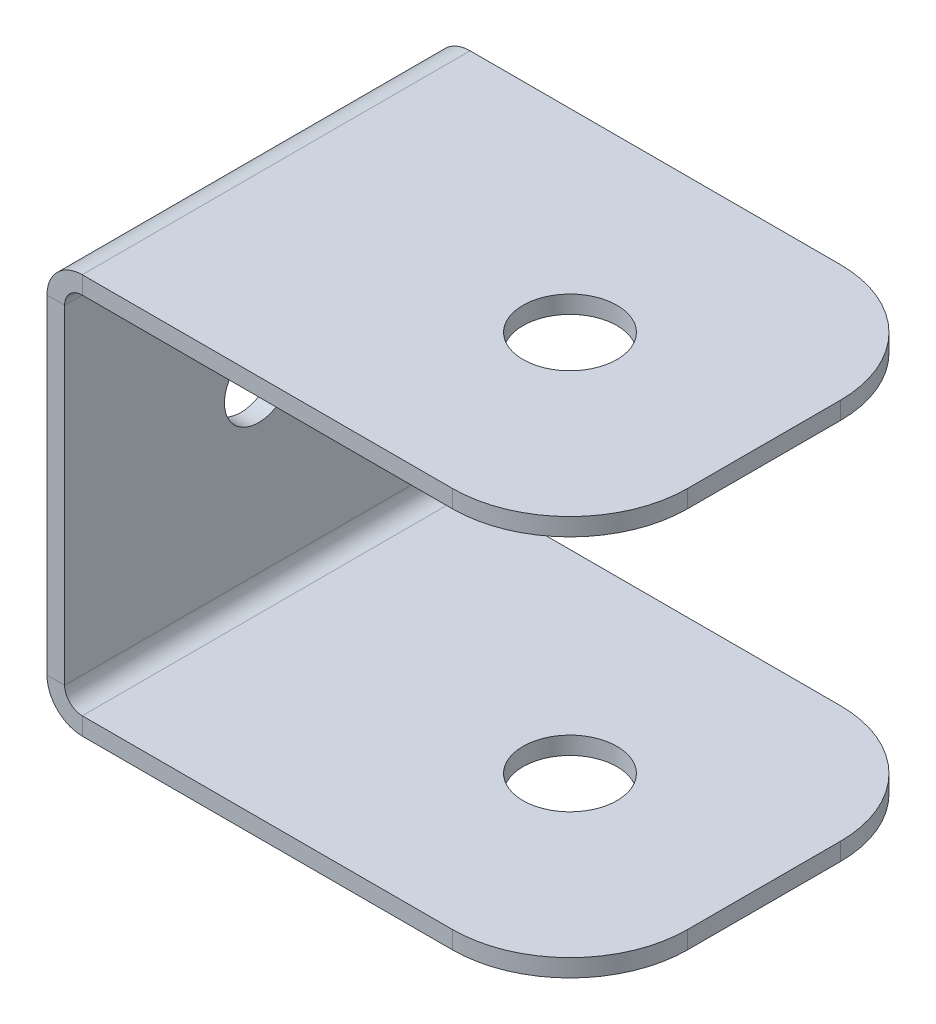
ISO-10303-21;
HEADER;
FILE_DESCRIPTION(('STEP AP214'),'2;1');
FILE_NAME('part.step','',(''),(''),'','','');
FILE_SCHEMA(('AUTOMOTIVE_DESIGN { 1 0 10303 214 1 1 1 1 }'));
ENDSEC;
DATA;
#1=APPLICATION_CONTEXT('core data for automotive mechanical design processes');
#2=APPLICATION_PROTOCOL_DEFINITION('international standard','automotive_design',2000,#1);
#3=PRODUCT_CONTEXT('',#1,'mechanical');
#4=PRODUCT('Part','Part','',(#3));
#5=PRODUCT_RELATED_PRODUCT_CATEGORY('part','',(#4));
#6=PRODUCT_DEFINITION_FORMATION('','',#4);
#7=PRODUCT_DEFINITION_CONTEXT('part definition',#1,'design');
#8=PRODUCT_DEFINITION('design','',#6,#7);
#9=PRODUCT_DEFINITION_SHAPE('','',#8);
#10=(LENGTH_UNIT() NAMED_UNIT(*) SI_UNIT(.MILLI.,.METRE.));
#11=(NAMED_UNIT(*) PLANE_ANGLE_UNIT() SI_UNIT($,.RADIAN.));
#12=(NAMED_UNIT(*) SI_UNIT($,.STERADIAN.) SOLID_ANGLE_UNIT());
#13=UNCERTAINTY_MEASURE_WITH_UNIT(LENGTH_MEASURE(1.E-05),#10,'distance_accuracy_value','');
#14=(GEOMETRIC_REPRESENTATION_CONTEXT(3) GLOBAL_UNCERTAINTY_ASSIGNED_CONTEXT((#13)) GLOBAL_UNIT_ASSIGNED_CONTEXT((#10,
#11,#12)) REPRESENTATION_CONTEXT('',''));
#15=CARTESIAN_POINT('',(0.,0.,0.));
#16=DIRECTION('',(0.,0.,1.));
#17=DIRECTION('',(1.,0.,0.));
#18=AXIS2_PLACEMENT_3D('',#15,#16,#17);
#19=CARTESIAN_POINT('',(0.,14.,16.5));
#20=DIRECTION('',(0.,0.,1.));
#21=DIRECTION('',(1.,0.,0.));
#22=AXIS2_PLACEMENT_3D('',#19,#20,#21);
#23=PLANE('',#22);
#24=DIRECTION('',(-1.,0.,0.));
#25=VECTOR('',#24,1.);
#26=CARTESIAN_POINT('',(0.,14.,16.5));
#27=LINE('',#26,#25);
#28=CARTESIAN_POINT('',(0.,14.,16.5));
#29=VERTEX_POINT('',#28);
#30=CARTESIAN_POINT('',(-1.5,14.,16.5));
#31=VERTEX_POINT('',#30);
#32=EDGE_CURVE('E319',#29,#31,#27,.T.);
#33=ORIENTED_EDGE('',*,*,#32,.F.);
#34=CARTESIAN_POINT('',(1.5,14.,16.5));
#35=DIRECTION('',(0.,0.,-1.));
#36=DIRECTION('',(-1.,0.,0.));
#37=AXIS2_PLACEMENT_3D('',#34,#35,#36);
#38=CIRCLE('',#37,1.5);
#39=CARTESIAN_POINT('',(1.5,15.5,16.5));
#40=VERTEX_POINT('',#39);
#41=EDGE_CURVE('E203',#40,#29,#38,.F.);
#42=ORIENTED_EDGE('',*,*,#41,.F.);
#43=DIRECTION('',(0.,-1.,0.));
#44=VECTOR('',#43,1.);
#45=CARTESIAN_POINT('',(1.5,17.,16.5));
#46=LINE('',#45,#44);
#47=CARTESIAN_POINT('',(1.5,17.,16.5));
#48=VERTEX_POINT('',#47);
#49=EDGE_CURVE('E315',#48,#40,#46,.T.);
#50=ORIENTED_EDGE('',*,*,#49,.F.);
#51=CARTESIAN_POINT('',(1.5,14.,16.5));
#52=DIRECTION('',(0.,0.,1.));
#53=DIRECTION('',(1.,0.,0.));
#54=AXIS2_PLACEMENT_3D('',#51,#52,#53);
#55=CIRCLE('',#54,3.);
#56=EDGE_CURVE('E216',#48,#31,#55,.T.);
#57=ORIENTED_EDGE('',*,*,#56,.T.);
#58=EDGE_LOOP('',(#33,#42,#50,#57));
#59=FACE_BOUND('',#58,.T.);
#60=ADVANCED_FACE('F41',(#59),#23,.T.);
#61=CARTESIAN_POINT('',(1.5,17.,16.5));
#62=DIRECTION('',(0.,0.,1.));
#63=DIRECTION('',(1.,0.,0.));
#64=AXIS2_PLACEMENT_3D('',#61,#62,#63);
#65=PLANE('',#64);
#66=DIRECTION('',(0.,-1.,0.));
#67=VECTOR('',#66,1.);
#68=CARTESIAN_POINT('',(0.,15.5,16.5));
#69=LINE('',#68,#67);
#70=CARTESIAN_POINT('',(0.,-14.,16.5));
#71=VERTEX_POINT('',#70);
#72=EDGE_CURVE('E199',#29,#71,#69,.T.);
#73=ORIENTED_EDGE('',*,*,#72,.F.);
#74=ORIENTED_EDGE('',*,*,#32,.T.);
#75=DIRECTION('',(0.,-1.,0.));
#76=VECTOR('',#75,1.);
#77=CARTESIAN_POINT('',(-1.5,15.5,16.5));
#78=LINE('',#77,#76);
#79=CARTESIAN_POINT('',(-1.5,-14.,16.5));
#80=VERTEX_POINT('',#79);
#81=EDGE_CURVE('E220',#31,#80,#78,.T.);
#82=ORIENTED_EDGE('',*,*,#81,.T.);
#83=DIRECTION('',(1.,0.,0.));
#84=VECTOR('',#83,1.);
#85=CARTESIAN_POINT('',(-1.5,-14.,16.5));
#86=LINE('',#85,#84);
#87=EDGE_CURVE('E170',#80,#71,#86,.T.);
#88=ORIENTED_EDGE('',*,*,#87,.T.);
#89=EDGE_LOOP('',(#73,#74,#82,#88));
#90=FACE_BOUND('',#89,.T.);
#91=ADVANCED_FACE('F402',(#90),#65,.T.);
#92=CARTESIAN_POINT('',(1.5,15.5,-16.5));
#93=DIRECTION('',(0.,0.,-1.));
#94=DIRECTION('',(-1.,0.,0.));
#95=AXIS2_PLACEMENT_3D('',#92,#93,#94);
#96=PLANE('',#95);
#97=DIRECTION('',(0.,1.,0.));
#98=VECTOR('',#97,1.);
#99=CARTESIAN_POINT('',(1.5,15.5,-16.5));
#100=LINE('',#99,#98);
#101=CARTESIAN_POINT('',(1.5,15.5,-16.5));
#102=VERTEX_POINT('',#101);
#103=CARTESIAN_POINT('',(1.5,17.,-16.5));
#104=VERTEX_POINT('',#103);
#105=EDGE_CURVE('E311',#102,#104,#100,.T.);
#106=ORIENTED_EDGE('',*,*,#105,.F.);
#107=CARTESIAN_POINT('',(1.5,14.,-16.5));
#108=DIRECTION('',(0.,0.,-1.));
#109=DIRECTION('',(-1.,0.,0.));
#110=AXIS2_PLACEMENT_3D('',#107,#108,#109);
#111=CIRCLE('',#110,1.5);
#112=CARTESIAN_POINT('',(0.,14.,-16.5));
#113=VERTEX_POINT('',#112);
#114=EDGE_CURVE('E241',#102,#113,#111,.F.);
#115=ORIENTED_EDGE('',*,*,#114,.T.);
#116=DIRECTION('',(1.,0.,0.));
#117=VECTOR('',#116,1.);
#118=CARTESIAN_POINT('',(-1.5,14.,-16.5));
#119=LINE('',#118,#117);
#120=CARTESIAN_POINT('',(-1.5,14.,-16.5));
#121=VERTEX_POINT('',#120);
#122=EDGE_CURVE('E169',#121,#113,#119,.T.);
#123=ORIENTED_EDGE('',*,*,#122,.F.);
#124=CARTESIAN_POINT('',(1.5,14.,-16.5));
#125=DIRECTION('',(0.,0.,1.));
#126=DIRECTION('',(1.,0.,0.));
#127=AXIS2_PLACEMENT_3D('',#124,#125,#126);
#128=CIRCLE('',#127,3.);
#129=EDGE_CURVE('E251',#104,#121,#128,.T.);
#130=ORIENTED_EDGE('',*,*,#129,.F.);
#131=EDGE_LOOP('',(#106,#115,#123,#130));
#132=FACE_BOUND('',#131,.T.);
#133=ADVANCED_FACE('F461',(#132),#96,.T.);
#134=CARTESIAN_POINT('',(-1.5,14.,-16.5));
#135=DIRECTION('',(0.,0.,-1.));
#136=DIRECTION('',(-1.,0.,0.));
#137=AXIS2_PLACEMENT_3D('',#134,#135,#136);
#138=PLANE('',#137);
#139=DIRECTION('',(-1.,0.,0.));
#140=VECTOR('',#139,1.);
#141=CARTESIAN_POINT('',(43.,17.,-16.5));
#142=LINE('',#141,#140);
#143=CARTESIAN_POINT('',(33.,17.,-16.5));
#144=VERTEX_POINT('',#143);
#145=EDGE_CURVE('E248',#144,#104,#142,.T.);
#146=ORIENTED_EDGE('',*,*,#145,.F.);
#147=DIRECTION('',(0.,-1.,0.));
#148=VECTOR('',#147,1.);
#149=CARTESIAN_POINT('',(33.,14.,-16.5));
#150=LINE('',#149,#148);
#151=CARTESIAN_POINT('',(33.,15.5,-16.5));
#152=VERTEX_POINT('',#151);
#153=EDGE_CURVE('E347',#144,#152,#150,.T.);
#154=ORIENTED_EDGE('',*,*,#153,.T.);
#155=DIRECTION('',(-1.,0.,0.));
#156=VECTOR('',#155,1.);
#157=CARTESIAN_POINT('',(43.,15.5,-16.5));
#158=LINE('',#157,#156);
#159=EDGE_CURVE('E245',#152,#102,#158,.T.);
#160=ORIENTED_EDGE('',*,*,#159,.T.);
#161=ORIENTED_EDGE('',*,*,#105,.T.);
#162=EDGE_LOOP('',(#146,#154,#160,#161));
#163=FACE_BOUND('',#162,.T.);
#164=ADVANCED_FACE('F375',(#163),#138,.T.);
#165=CARTESIAN_POINT('',(1.5,-15.5,16.5));
#166=DIRECTION('',(0.,0.,1.));
#167=DIRECTION('',(1.,0.,0.));
#168=AXIS2_PLACEMENT_3D('',#165,#166,#167);
#169=PLANE('',#168);
#170=DIRECTION('',(0.,-1.,0.));
#171=VECTOR('',#170,1.);
#172=CARTESIAN_POINT('',(1.5,-15.5,16.5));
#173=LINE('',#172,#171);
#174=CARTESIAN_POINT('',(1.5,-15.5,16.5));
#175=VERTEX_POINT('',#174);
#176=CARTESIAN_POINT('',(1.5,-17.,16.5));
#177=VERTEX_POINT('',#176);
#178=EDGE_CURVE('E156',#175,#177,#173,.T.);
#179=ORIENTED_EDGE('',*,*,#178,.F.);
#180=CARTESIAN_POINT('',(1.5,-14.,16.5));
#181=DIRECTION('',(0.,0.,-1.));
#182=DIRECTION('',(-1.,0.,0.));
#183=AXIS2_PLACEMENT_3D('',#180,#181,#182);
#184=CIRCLE('',#183,1.5);
#185=EDGE_CURVE('E160',#71,#175,#184,.F.);
#186=ORIENTED_EDGE('',*,*,#185,.F.);
#187=ORIENTED_EDGE('',*,*,#87,.F.);
#188=CARTESIAN_POINT('',(1.5,-14.,16.5));
#189=DIRECTION('',(0.,0.,1.));
#190=DIRECTION('',(1.,0.,0.));
#191=AXIS2_PLACEMENT_3D('',#188,#189,#190);
#192=CIRCLE('',#191,3.);
#193=EDGE_CURVE('E163',#80,#177,#192,.T.);
#194=ORIENTED_EDGE('',*,*,#193,.T.);
#195=EDGE_LOOP('',(#179,#186,#187,#194));
#196=FACE_BOUND('',#195,.T.);
#197=ADVANCED_FACE('F158',(#196),#169,.T.);
#198=CARTESIAN_POINT('',(-1.5,-14.,16.5));
#199=DIRECTION('',(0.,0.,1.));
#200=DIRECTION('',(1.,0.,0.));
#201=AXIS2_PLACEMENT_3D('',#198,#199,#200);
#202=PLANE('',#201);
#203=DIRECTION('',(1.,0.,0.));
#204=VECTOR('',#203,1.);
#205=CARTESIAN_POINT('',(0.,-17.,16.5));
#206=LINE('',#205,#204);
#207=CARTESIAN_POINT('',(33.,-17.,16.5));
#208=VERTEX_POINT('',#207);
#209=EDGE_CURVE('E193',#177,#208,#206,.T.);
#210=ORIENTED_EDGE('',*,*,#209,.T.);
#211=DIRECTION('',(0.,-1.,0.));
#212=VECTOR('',#211,1.);
#213=CARTESIAN_POINT('',(33.,-14.,16.5));
#214=LINE('',#213,#212);
#215=CARTESIAN_POINT('',(33.,-15.5,16.5));
#216=VERTEX_POINT('',#215);
#217=EDGE_CURVE('E191',#208,#216,#214,.F.);
#218=ORIENTED_EDGE('',*,*,#217,.T.);
#219=DIRECTION('',(1.,0.,0.));
#220=VECTOR('',#219,1.);
#221=CARTESIAN_POINT('',(0.,-15.5,16.5));
#222=LINE('',#221,#220);
#223=EDGE_CURVE('E178',#175,#216,#222,.T.);
#224=ORIENTED_EDGE('',*,*,#223,.F.);
#225=ORIENTED_EDGE('',*,*,#178,.T.);
#226=EDGE_LOOP('',(#210,#218,#224,#225));
#227=FACE_BOUND('',#226,.T.);
#228=ADVANCED_FACE('F189',(#227),#202,.T.);
#229=CARTESIAN_POINT('',(0.,-14.,-16.5));
#230=DIRECTION('',(0.,0.,-1.));
#231=DIRECTION('',(-1.,0.,0.));
#232=AXIS2_PLACEMENT_3D('',#229,#230,#231);
#233=PLANE('',#232);
#234=DIRECTION('',(-1.,0.,0.));
#235=VECTOR('',#234,1.);
#236=CARTESIAN_POINT('',(0.,-14.,-16.5));
#237=LINE('',#236,#235);
#238=CARTESIAN_POINT('',(0.,-14.,-16.5));
#239=VERTEX_POINT('',#238);
#240=CARTESIAN_POINT('',(-1.5,-14.,-16.5));
#241=VERTEX_POINT('',#240);
#242=EDGE_CURVE('E304',#239,#241,#237,.T.);
#243=ORIENTED_EDGE('',*,*,#242,.F.);
#244=CARTESIAN_POINT('',(1.5,-14.,-16.5));
#245=DIRECTION('',(0.,0.,-1.));
#246=DIRECTION('',(-1.,0.,0.));
#247=AXIS2_PLACEMENT_3D('',#244,#245,#246);
#248=CIRCLE('',#247,1.5);
#249=CARTESIAN_POINT('',(1.5,-15.5,-16.5));
#250=VERTEX_POINT('',#249);
#251=EDGE_CURVE('E234',#239,#250,#248,.F.);
#252=ORIENTED_EDGE('',*,*,#251,.T.);
#253=DIRECTION('',(0.,1.,0.));
#254=VECTOR('',#253,1.);
#255=CARTESIAN_POINT('',(1.5,-17.,-16.5));
#256=LINE('',#255,#254);
#257=CARTESIAN_POINT('',(1.5,-17.,-16.5));
#258=VERTEX_POINT('',#257);
#259=EDGE_CURVE('E301',#258,#250,#256,.T.);
#260=ORIENTED_EDGE('',*,*,#259,.F.);
#261=CARTESIAN_POINT('',(1.5,-14.,-16.5));
#262=DIRECTION('',(0.,0.,1.));
#263=DIRECTION('',(1.,0.,0.));
#264=AXIS2_PLACEMENT_3D('',#261,#262,#263);
#265=CIRCLE('',#264,3.);
#266=EDGE_CURVE('E259',#241,#258,#265,.T.);
#267=ORIENTED_EDGE('',*,*,#266,.F.);
#268=EDGE_LOOP('',(#243,#252,#260,#267));
#269=FACE_BOUND('',#268,.T.);
#270=ADVANCED_FACE('F647',(#269),#233,.T.);
#271=CARTESIAN_POINT('',(1.5,-17.,-16.5));
#272=DIRECTION('',(0.,0.,-1.));
#273=DIRECTION('',(-1.,0.,0.));
#274=AXIS2_PLACEMENT_3D('',#271,#272,#273);
#275=PLANE('',#274);
#276=DIRECTION('',(0.,-1.,0.));
#277=VECTOR('',#276,1.);
#278=CARTESIAN_POINT('',(0.,15.5,-16.5));
#279=LINE('',#278,#277);
#280=EDGE_CURVE('E237',#113,#239,#279,.T.);
#281=ORIENTED_EDGE('',*,*,#280,.T.);
#282=ORIENTED_EDGE('',*,*,#242,.T.);
#283=DIRECTION('',(0.,-1.,0.));
#284=VECTOR('',#283,1.);
#285=CARTESIAN_POINT('',(-1.5,15.5,-16.5));
#286=LINE('',#285,#284);
#287=EDGE_CURVE('E255',#121,#241,#286,.T.);
#288=ORIENTED_EDGE('',*,*,#287,.F.);
#289=ORIENTED_EDGE('',*,*,#122,.T.);
#290=EDGE_LOOP('',(#281,#282,#288,#289));
#291=FACE_BOUND('',#290,.T.);
#292=ADVANCED_FACE('F637',(#291),#275,.T.);
#293=CARTESIAN_POINT('',(0.,-17.,16.5));
#294=DIRECTION('',(0.,1.,0.));
#295=DIRECTION('',(-1.,0.,0.));
#296=AXIS2_PLACEMENT_3D('',#293,#294,#295);
#297=PLANE('',#296);
#298=CARTESIAN_POINT('',(26.5,-17.,0.));
#299=DIRECTION('',(0.,1.,0.));
#300=DIRECTION('',(0.,0.,1.));
#301=AXIS2_PLACEMENT_3D('',#298,#299,#300);
#302=CIRCLE('',#301,4.00000000000001);
#303=CARTESIAN_POINT('',(26.5,-17.,4.00000000000001));
#304=VERTEX_POINT('',#303);
#305=EDGE_CURVE('E426',#304,#304,#302,.T.);
#306=ORIENTED_EDGE('',*,*,#305,.T.);
#307=EDGE_LOOP('',(#306));
#308=FACE_BOUND('',#307,.T.);
#309=DIRECTION('',(0.,0.,-1.));
#310=VECTOR('',#309,1.);
#311=CARTESIAN_POINT('',(43.,-17.,16.5));
#312=LINE('',#311,#310);
#313=CARTESIAN_POINT('',(43.,-17.,6.5));
#314=VERTEX_POINT('',#313);
#315=CARTESIAN_POINT('',(43.,-17.,-6.5));
#316=VERTEX_POINT('',#315);
#317=EDGE_CURVE('E297',#314,#316,#312,.T.);
#318=ORIENTED_EDGE('',*,*,#317,.F.);
#319=CARTESIAN_POINT('',(33.,-17.,6.5));
#320=DIRECTION('',(0.,1.,0.));
#321=DIRECTION('',(-1.,0.,0.));
#322=AXIS2_PLACEMENT_3D('',#319,#320,#321);
#323=CIRCLE('',#322,10.);
#324=EDGE_CURVE('E332',#314,#208,#323,.F.);
#325=ORIENTED_EDGE('',*,*,#324,.T.);
#326=ORIENTED_EDGE('',*,*,#209,.F.);
#327=DIRECTION('',(0.,0.,-1.));
#328=VECTOR('',#327,1.);
#329=CARTESIAN_POINT('',(1.5,-17.,16.5));
#330=LINE('',#329,#328);
#331=EDGE_CURVE('E226',#177,#258,#330,.T.);
#332=ORIENTED_EDGE('',*,*,#331,.T.);
#333=DIRECTION('',(1.,0.,0.));
#334=VECTOR('',#333,1.);
#335=CARTESIAN_POINT('',(0.,-17.,-16.5));
#336=LINE('',#335,#334);
#337=CARTESIAN_POINT('',(33.,-17.,-16.5));
#338=VERTEX_POINT('',#337);
#339=EDGE_CURVE('E227',#258,#338,#336,.T.);
#340=ORIENTED_EDGE('',*,*,#339,.T.);
#341=CARTESIAN_POINT('',(33.,-17.,-6.5));
#342=DIRECTION('',(0.,1.,0.));
#343=DIRECTION('',(-1.,0.,0.));
#344=AXIS2_PLACEMENT_3D('',#341,#342,#343);
#345=CIRCLE('',#344,10.);
#346=EDGE_CURVE('E329',#338,#316,#345,.F.);
#347=ORIENTED_EDGE('',*,*,#346,.T.);
#348=EDGE_LOOP('',(#318,#325,#326,#332,#340,#347));
#349=FACE_BOUND('',#348,.T.);
#350=ADVANCED_FACE('F415',(#308,#349),#297,.F.);
#351=CARTESIAN_POINT('',(43.,-15.5,16.5));
#352=DIRECTION('',(1.,0.,0.));
#353=DIRECTION('',(0.,0.,-1.));
#354=AXIS2_PLACEMENT_3D('',#351,#352,#353);
#355=PLANE('',#354);
#356=DIRECTION('',(0.,0.,-1.));
#357=VECTOR('',#356,1.);
#358=CARTESIAN_POINT('',(43.,-15.5,16.5));
#359=LINE('',#358,#357);
#360=CARTESIAN_POINT('',(43.,-15.5,6.5));
#361=VERTEX_POINT('',#360);
#362=CARTESIAN_POINT('',(43.,-15.5,-6.5));
#363=VERTEX_POINT('',#362);
#364=EDGE_CURVE('E186',#361,#363,#359,.T.);
#365=ORIENTED_EDGE('',*,*,#364,.F.);
#366=DIRECTION('',(0.,-1.,0.));
#367=VECTOR('',#366,1.);
#368=CARTESIAN_POINT('',(43.,-15.5,6.5));
#369=LINE('',#368,#367);
#370=EDGE_CURVE('E325',#361,#314,#369,.T.);
#371=ORIENTED_EDGE('',*,*,#370,.T.);
#372=ORIENTED_EDGE('',*,*,#317,.T.);
#373=DIRECTION('',(0.,-1.,0.));
#374=VECTOR('',#373,1.);
#375=CARTESIAN_POINT('',(43.,-15.5,-6.5));
#376=LINE('',#375,#374);
#377=EDGE_CURVE('E322',#316,#363,#376,.F.);
#378=ORIENTED_EDGE('',*,*,#377,.T.);
#379=EDGE_LOOP('',(#365,#371,#372,#378));
#380=FACE_BOUND('',#379,.T.);
#381=ADVANCED_FACE('F618',(#380),#355,.T.);
#382=CARTESIAN_POINT('',(0.,-15.5,16.5));
#383=DIRECTION('',(0.,1.,0.));
#384=DIRECTION('',(-1.,0.,0.));
#385=AXIS2_PLACEMENT_3D('',#382,#383,#384);
#386=PLANE('',#385);
#387=CARTESIAN_POINT('',(26.5,-15.5,0.));
#388=DIRECTION('',(0.,1.,0.));
#389=DIRECTION('',(-1.,0.,0.));
#390=AXIS2_PLACEMENT_3D('',#387,#388,#389);
#391=CIRCLE('',#390,4.00000000000001);
#392=CARTESIAN_POINT('',(22.5,-15.5,0.));
#393=VERTEX_POINT('',#392);
#394=EDGE_CURVE('E231',#393,#393,#391,.T.);
#395=ORIENTED_EDGE('',*,*,#394,.F.);
#396=EDGE_LOOP('',(#395));
#397=FACE_BOUND('',#396,.T.);
#398=ORIENTED_EDGE('',*,*,#223,.T.);
#399=CARTESIAN_POINT('',(33.,-15.5,6.5));
#400=DIRECTION('',(0.,1.,0.));
#401=DIRECTION('',(-1.,0.,0.));
#402=AXIS2_PLACEMENT_3D('',#399,#400,#401);
#403=CIRCLE('',#402,10.);
#404=EDGE_CURVE('E340',#216,#361,#403,.T.);
#405=ORIENTED_EDGE('',*,*,#404,.T.);
#406=ORIENTED_EDGE('',*,*,#364,.T.);
#407=CARTESIAN_POINT('',(33.,-15.5,-6.5));
#408=DIRECTION('',(0.,1.,0.));
#409=DIRECTION('',(-1.,0.,0.));
#410=AXIS2_PLACEMENT_3D('',#407,#408,#409);
#411=CIRCLE('',#410,10.);
#412=CARTESIAN_POINT('',(33.,-15.5,-16.5));
#413=VERTEX_POINT('',#412);
#414=EDGE_CURVE('E337',#363,#413,#411,.T.);
#415=ORIENTED_EDGE('',*,*,#414,.T.);
#416=DIRECTION('',(1.,0.,0.));
#417=VECTOR('',#416,1.);
#418=CARTESIAN_POINT('',(0.,-15.5,-16.5));
#419=LINE('',#418,#417);
#420=EDGE_CURVE('E181',#250,#413,#419,.T.);
#421=ORIENTED_EDGE('',*,*,#420,.F.);
#422=DIRECTION('',(0.,0.,-1.));
#423=VECTOR('',#422,1.);
#424=CARTESIAN_POINT('',(1.5,-15.5,16.5));
#425=LINE('',#424,#423);
#426=EDGE_CURVE('E176',#175,#250,#425,.T.);
#427=ORIENTED_EDGE('',*,*,#426,.F.);
#428=EDGE_LOOP('',(#398,#405,#406,#415,#421,#427));
#429=FACE_BOUND('',#428,.T.);
#430=ADVANCED_FACE('F177',(#397,#429),#386,.T.);
#431=CARTESIAN_POINT('',(1.5,-14.,16.5));
#432=DIRECTION('',(0.,0.,-1.));
#433=DIRECTION('',(-1.,0.,0.));
#434=AXIS2_PLACEMENT_3D('',#431,#432,#433);
#435=CYLINDRICAL_SURFACE('',#434,1.5);
#436=ORIENTED_EDGE('',*,*,#251,.F.);
#437=DIRECTION('',(0.,0.,-1.));
#438=VECTOR('',#437,1.);
#439=CARTESIAN_POINT('',(0.,-14.,16.5));
#440=LINE('',#439,#438);
#441=EDGE_CURVE('E187',#71,#239,#440,.T.);
#442=ORIENTED_EDGE('',*,*,#441,.F.);
#443=ORIENTED_EDGE('',*,*,#185,.T.);
#444=ORIENTED_EDGE('',*,*,#426,.T.);
#445=EDGE_LOOP('',(#436,#442,#443,#444));
#446=FACE_BOUND('',#445,.T.);
#447=ADVANCED_FACE('F196',(#446),#435,.F.);
#448=CARTESIAN_POINT('',(0.,15.5,16.5));
#449=DIRECTION('',(1.,0.,0.));
#450=DIRECTION('',(0.,1.,0.));
#451=AXIS2_PLACEMENT_3D('',#448,#449,#450);
#452=PLANE('',#451);
#453=CARTESIAN_POINT('',(0.,0.,0.));
#454=DIRECTION('',(1.,0.,0.));
#455=DIRECTION('',(0.,1.,0.));
#456=AXIS2_PLACEMENT_3D('',#453,#454,#455);
#457=CIRCLE('',#456,2.89999999999999);
#458=CARTESIAN_POINT('',(0.,2.89999999999999,0.));
#459=VERTEX_POINT('',#458);
#460=EDGE_CURVE('E431',#459,#459,#457,.T.);
#461=ORIENTED_EDGE('',*,*,#460,.F.);
#462=EDGE_LOOP('',(#461));
#463=FACE_BOUND('',#462,.T.);
#464=ORIENTED_EDGE('',*,*,#280,.F.);
#465=DIRECTION('',(0.,0.,-1.));
#466=VECTOR('',#465,1.);
#467=CARTESIAN_POINT('',(0.,14.,16.5));
#468=LINE('',#467,#466);
#469=EDGE_CURVE('E288',#29,#113,#468,.T.);
#470=ORIENTED_EDGE('',*,*,#469,.F.);
#471=ORIENTED_EDGE('',*,*,#72,.T.);
#472=ORIENTED_EDGE('',*,*,#441,.T.);
#473=EDGE_LOOP('',(#464,#470,#471,#472));
#474=FACE_BOUND('',#473,.T.);
#475=ADVANCED_FACE('F401',(#463,#474),#452,.T.);
#476=CARTESIAN_POINT('',(1.5,14.,16.5));
#477=DIRECTION('',(0.,0.,-1.));
#478=DIRECTION('',(-1.,0.,0.));
#479=AXIS2_PLACEMENT_3D('',#476,#477,#478);
#480=CYLINDRICAL_SURFACE('',#479,1.5);
#481=ORIENTED_EDGE('',*,*,#114,.F.);
#482=DIRECTION('',(0.,0.,-1.));
#483=VECTOR('',#482,1.);
#484=CARTESIAN_POINT('',(1.5,15.5,16.5));
#485=LINE('',#484,#483);
#486=EDGE_CURVE('E284',#40,#102,#485,.T.);
#487=ORIENTED_EDGE('',*,*,#486,.F.);
#488=ORIENTED_EDGE('',*,*,#41,.T.);
#489=ORIENTED_EDGE('',*,*,#469,.T.);
#490=EDGE_LOOP('',(#481,#487,#488,#489));
#491=FACE_BOUND('',#490,.T.);
#492=ADVANCED_FACE('F393',(#491),#480,.F.);
#493=CARTESIAN_POINT('',(43.,15.5,16.5));
#494=DIRECTION('',(0.,-1.,0.));
#495=DIRECTION('',(1.,0.,0.));
#496=AXIS2_PLACEMENT_3D('',#493,#494,#495);
#497=PLANE('',#496);
#498=CARTESIAN_POINT('',(26.5,15.5,0.));
#499=DIRECTION('',(0.,-1.,0.));
#500=DIRECTION('',(1.,0.,0.));
#501=AXIS2_PLACEMENT_3D('',#498,#499,#500);
#502=CIRCLE('',#501,4.00000000000001);
#503=CARTESIAN_POINT('',(30.5,15.5,0.));
#504=VERTEX_POINT('',#503);
#505=EDGE_CURVE('E422',#504,#504,#502,.T.);
#506=ORIENTED_EDGE('',*,*,#505,.F.);
#507=EDGE_LOOP('',(#506));
#508=FACE_BOUND('',#507,.T.);
#509=ORIENTED_EDGE('',*,*,#159,.F.);
#510=CARTESIAN_POINT('',(33.,15.5,-6.5));
#511=DIRECTION('',(0.,-1.,0.));
#512=DIRECTION('',(1.,0.,0.));
#513=AXIS2_PLACEMENT_3D('',#510,#511,#512);
#514=CIRCLE('',#513,10.);
#515=CARTESIAN_POINT('',(43.,15.5,-6.5));
#516=VERTEX_POINT('',#515);
#517=EDGE_CURVE('E354',#152,#516,#514,.T.);
#518=ORIENTED_EDGE('',*,*,#517,.T.);
#519=DIRECTION('',(0.,0.,-1.));
#520=VECTOR('',#519,1.);
#521=CARTESIAN_POINT('',(43.,15.5,16.5));
#522=LINE('',#521,#520);
#523=CARTESIAN_POINT('',(43.,15.5,6.5));
#524=VERTEX_POINT('',#523);
#525=EDGE_CURVE('E281',#524,#516,#522,.T.);
#526=ORIENTED_EDGE('',*,*,#525,.F.);
#527=CARTESIAN_POINT('',(33.,15.5,6.5));
#528=DIRECTION('',(0.,-1.,0.));
#529=DIRECTION('',(1.,0.,0.));
#530=AXIS2_PLACEMENT_3D('',#527,#528,#529);
#531=CIRCLE('',#530,10.);
#532=CARTESIAN_POINT('',(33.,15.5,16.5));
#533=VERTEX_POINT('',#532);
#534=EDGE_CURVE('E351',#524,#533,#531,.T.);
#535=ORIENTED_EDGE('',*,*,#534,.T.);
#536=DIRECTION('',(-1.,0.,0.));
#537=VECTOR('',#536,1.);
#538=CARTESIAN_POINT('',(43.,15.5,16.5));
#539=LINE('',#538,#537);
#540=EDGE_CURVE('E210',#533,#40,#539,.T.);
#541=ORIENTED_EDGE('',*,*,#540,.T.);
#542=ORIENTED_EDGE('',*,*,#486,.T.);
#543=EDGE_LOOP('',(#509,#518,#526,#535,#541,#542));
#544=FACE_BOUND('',#543,.T.);
#545=ADVANCED_FACE('F381',(#508,#544),#497,.T.);
#546=CARTESIAN_POINT('',(43.,17.,16.5));
#547=DIRECTION('',(1.,0.,0.));
#548=DIRECTION('',(0.,0.,-1.));
#549=AXIS2_PLACEMENT_3D('',#546,#547,#548);
#550=PLANE('',#549);
#551=ORIENTED_EDGE('',*,*,#525,.T.);
#552=DIRECTION('',(0.,-1.,0.));
#553=VECTOR('',#552,1.);
#554=CARTESIAN_POINT('',(43.,17.,-6.5));
#555=LINE('',#554,#553);
#556=CARTESIAN_POINT('',(43.,17.,-6.5));
#557=VERTEX_POINT('',#556);
#558=EDGE_CURVE('E63',#516,#557,#555,.F.);
#559=ORIENTED_EDGE('',*,*,#558,.T.);
#560=DIRECTION('',(0.,0.,-1.));
#561=VECTOR('',#560,1.);
#562=CARTESIAN_POINT('',(43.,17.,16.5));
#563=LINE('',#562,#561);
#564=CARTESIAN_POINT('',(43.,17.,6.5));
#565=VERTEX_POINT('',#564);
#566=EDGE_CURVE('E278',#565,#557,#563,.T.);
#567=ORIENTED_EDGE('',*,*,#566,.F.);
#568=DIRECTION('',(0.,-1.,0.));
#569=VECTOR('',#568,1.);
#570=CARTESIAN_POINT('',(43.,15.5,6.5));
#571=LINE('',#570,#569);
#572=EDGE_CURVE('E357',#565,#524,#571,.T.);
#573=ORIENTED_EDGE('',*,*,#572,.T.);
#574=EDGE_LOOP('',(#551,#559,#567,#573));
#575=FACE_BOUND('',#574,.T.);
#576=ADVANCED_FACE('F382',(#575),#550,.T.);
#577=CARTESIAN_POINT('',(43.,17.,16.5));
#578=DIRECTION('',(0.,-1.,0.));
#579=DIRECTION('',(1.,0.,0.));
#580=AXIS2_PLACEMENT_3D('',#577,#578,#579);
#581=PLANE('',#580);
#582=CARTESIAN_POINT('',(26.5,17.,0.));
#583=DIRECTION('',(0.,1.,0.));
#584=DIRECTION('',(0.,0.,1.));
#585=AXIS2_PLACEMENT_3D('',#582,#583,#584);
#586=CIRCLE('',#585,4.00000000000001);
#587=CARTESIAN_POINT('',(26.5,17.,4.00000000000001));
#588=VERTEX_POINT('',#587);
#589=EDGE_CURVE('E427',#588,#588,#586,.T.);
#590=ORIENTED_EDGE('',*,*,#589,.F.);
#591=EDGE_LOOP('',(#590));
#592=FACE_BOUND('',#591,.T.);
#593=ORIENTED_EDGE('',*,*,#566,.T.);
#594=CARTESIAN_POINT('',(33.,17.,-6.5));
#595=DIRECTION('',(0.,-1.,0.));
#596=DIRECTION('',(1.,0.,0.));
#597=AXIS2_PLACEMENT_3D('',#594,#595,#596);
#598=CIRCLE('',#597,10.);
#599=EDGE_CURVE('E50',#557,#144,#598,.F.);
#600=ORIENTED_EDGE('',*,*,#599,.T.);
#601=ORIENTED_EDGE('',*,*,#145,.T.);
#602=DIRECTION('',(0.,0.,-1.));
#603=VECTOR('',#602,1.);
#604=CARTESIAN_POINT('',(1.5,17.,16.5));
#605=LINE('',#604,#603);
#606=EDGE_CURVE('E274',#48,#104,#605,.T.);
#607=ORIENTED_EDGE('',*,*,#606,.F.);
#608=DIRECTION('',(-1.,0.,0.));
#609=VECTOR('',#608,1.);
#610=CARTESIAN_POINT('',(43.,17.,16.5));
#611=LINE('',#610,#609);
#612=CARTESIAN_POINT('',(33.,17.,16.5));
#613=VERTEX_POINT('',#612);
#614=EDGE_CURVE('E213',#613,#48,#611,.T.);
#615=ORIENTED_EDGE('',*,*,#614,.F.);
#616=CARTESIAN_POINT('',(33.,17.,6.5));
#617=DIRECTION('',(0.,-1.,0.));
#618=DIRECTION('',(1.,0.,0.));
#619=AXIS2_PLACEMENT_3D('',#616,#617,#618);
#620=CIRCLE('',#619,10.);
#621=EDGE_CURVE('E363',#613,#565,#620,.F.);
#622=ORIENTED_EDGE('',*,*,#621,.T.);
#623=EDGE_LOOP('',(#593,#600,#601,#607,#615,#622));
#624=FACE_BOUND('',#623,.T.);
#625=ADVANCED_FACE('F370',(#592,#624),#581,.F.);
#626=CARTESIAN_POINT('',(1.5,14.,16.5));
#627=DIRECTION('',(0.,0.,-1.));
#628=DIRECTION('',(-1.,0.,0.));
#629=AXIS2_PLACEMENT_3D('',#626,#627,#628);
#630=CYLINDRICAL_SURFACE('',#629,3.);
#631=ORIENTED_EDGE('',*,*,#129,.T.);
#632=DIRECTION('',(0.,0.,-1.));
#633=VECTOR('',#632,1.);
#634=CARTESIAN_POINT('',(-1.5,14.,16.5));
#635=LINE('',#634,#633);
#636=EDGE_CURVE('E270',#31,#121,#635,.T.);
#637=ORIENTED_EDGE('',*,*,#636,.F.);
#638=ORIENTED_EDGE('',*,*,#56,.F.);
#639=ORIENTED_EDGE('',*,*,#606,.T.);
#640=EDGE_LOOP('',(#631,#637,#638,#639));
#641=FACE_BOUND('',#640,.T.);
#642=ADVANCED_FACE('F447',(#641),#630,.T.);
#643=CARTESIAN_POINT('',(-1.5,15.5,16.5));
#644=DIRECTION('',(1.,0.,0.));
#645=DIRECTION('',(0.,1.,0.));
#646=AXIS2_PLACEMENT_3D('',#643,#644,#645);
#647=PLANE('',#646);
#648=CARTESIAN_POINT('',(-1.5,0.,0.));
#649=DIRECTION('',(-1.,0.,0.));
#650=DIRECTION('',(0.,0.,1.));
#651=AXIS2_PLACEMENT_3D('',#648,#649,#650);
#652=CIRCLE('',#651,2.9);
#653=CARTESIAN_POINT('',(-1.5,0.,2.9));
#654=VERTEX_POINT('',#653);
#655=EDGE_CURVE('E438',#654,#654,#652,.T.);
#656=ORIENTED_EDGE('',*,*,#655,.F.);
#657=EDGE_LOOP('',(#656));
#658=FACE_BOUND('',#657,.T.);
#659=ORIENTED_EDGE('',*,*,#287,.T.);
#660=DIRECTION('',(0.,0.,-1.));
#661=VECTOR('',#660,1.);
#662=CARTESIAN_POINT('',(-1.5,-14.,16.5));
#663=LINE('',#662,#661);
#664=EDGE_CURVE('E266',#80,#241,#663,.T.);
#665=ORIENTED_EDGE('',*,*,#664,.F.);
#666=ORIENTED_EDGE('',*,*,#81,.F.);
#667=ORIENTED_EDGE('',*,*,#636,.T.);
#668=EDGE_LOOP('',(#659,#665,#666,#667));
#669=FACE_BOUND('',#668,.T.);
#670=ADVANCED_FACE('F406',(#658,#669),#647,.F.);
#671=CARTESIAN_POINT('',(1.5,-14.,16.5));
#672=DIRECTION('',(0.,0.,-1.));
#673=DIRECTION('',(-1.,0.,0.));
#674=AXIS2_PLACEMENT_3D('',#671,#672,#673);
#675=CYLINDRICAL_SURFACE('',#674,3.);
#676=ORIENTED_EDGE('',*,*,#266,.T.);
#677=ORIENTED_EDGE('',*,*,#331,.F.);
#678=ORIENTED_EDGE('',*,*,#193,.F.);
#679=ORIENTED_EDGE('',*,*,#664,.T.);
#680=EDGE_LOOP('',(#676,#677,#678,#679));
#681=FACE_BOUND('',#680,.T.);
#682=ADVANCED_FACE('F410',(#681),#675,.T.);
#683=CARTESIAN_POINT('',(1.5,-14.,16.5));
#684=DIRECTION('',(0.,0.,-1.));
#685=DIRECTION('',(-1.,0.,0.));
#686=AXIS2_PLACEMENT_3D('',#683,#684,#685);
#687=PLANE('',#686);
#688=ORIENTED_EDGE('',*,*,#540,.F.);
#689=DIRECTION('',(0.,-1.,0.));
#690=VECTOR('',#689,1.);
#691=CARTESIAN_POINT('',(33.,17.,16.5));
#692=LINE('',#691,#690);
#693=EDGE_CURVE('E11',#533,#613,#692,.F.);
#694=ORIENTED_EDGE('',*,*,#693,.T.);
#695=ORIENTED_EDGE('',*,*,#614,.T.);
#696=ORIENTED_EDGE('',*,*,#49,.T.);
#697=EDGE_LOOP('',(#688,#694,#695,#696));
#698=FACE_BOUND('',#697,.T.);
#699=ADVANCED_FACE('F386',(#698),#687,.F.);
#700=CARTESIAN_POINT('',(1.5,-14.,-16.5));
#701=DIRECTION('',(0.,0.,-1.));
#702=DIRECTION('',(-1.,0.,0.));
#703=AXIS2_PLACEMENT_3D('',#700,#701,#702);
#704=PLANE('',#703);
#705=ORIENTED_EDGE('',*,*,#420,.T.);
#706=DIRECTION('',(0.,-1.,0.));
#707=VECTOR('',#706,1.);
#708=CARTESIAN_POINT('',(33.,-14.,-16.5));
#709=LINE('',#708,#707);
#710=EDGE_CURVE('E343',#413,#338,#709,.T.);
#711=ORIENTED_EDGE('',*,*,#710,.T.);
#712=ORIENTED_EDGE('',*,*,#339,.F.);
#713=ORIENTED_EDGE('',*,*,#259,.T.);
#714=EDGE_LOOP('',(#705,#711,#712,#713));
#715=FACE_BOUND('',#714,.T.);
#716=ADVANCED_FACE('F527',(#715),#704,.T.);
#717=CARTESIAN_POINT('',(26.5,-17.,0.));
#718=DIRECTION('',(0.,1.,0.));
#719=DIRECTION('',(0.,0.,1.));
#720=AXIS2_PLACEMENT_3D('',#717,#718,#719);
#721=CYLINDRICAL_SURFACE('',#720,4.00000000000001);
#722=ORIENTED_EDGE('',*,*,#505,.T.);
#723=EDGE_LOOP('',(#722));
#724=FACE_BOUND('',#723,.T.);
#725=ORIENTED_EDGE('',*,*,#589,.T.);
#726=EDGE_LOOP('',(#725));
#727=FACE_BOUND('',#726,.T.);
#728=ADVANCED_FACE('F516',(#724,#727),#721,.F.);
#729=ORIENTED_EDGE('',*,*,#394,.T.);
#730=EDGE_LOOP('',(#729));
#731=FACE_BOUND('',#730,.T.);
#732=ORIENTED_EDGE('',*,*,#305,.F.);
#733=EDGE_LOOP('',(#732));
#734=FACE_BOUND('',#733,.T.);
#735=ADVANCED_FACE('F504',(#731,#734),#721,.F.);
#736=CARTESIAN_POINT('',(-1.5,0.,0.));
#737=DIRECTION('',(-1.,0.,0.));
#738=DIRECTION('',(0.,0.,1.));
#739=AXIS2_PLACEMENT_3D('',#736,#737,#738);
#740=CYLINDRICAL_SURFACE('',#739,2.89999999999999);
#741=ORIENTED_EDGE('',*,*,#460,.T.);
#742=EDGE_LOOP('',(#741));
#743=FACE_BOUND('',#742,.T.);
#744=ORIENTED_EDGE('',*,*,#655,.T.);
#745=EDGE_LOOP('',(#744));
#746=FACE_BOUND('',#745,.T.);
#747=ADVANCED_FACE('F444',(#743,#746),#740,.F.);
#748=CARTESIAN_POINT('',(33.,-15.5,6.5));
#749=DIRECTION('',(0.,-1.,0.));
#750=DIRECTION('',(0.,0.,-1.));
#751=AXIS2_PLACEMENT_3D('',#748,#749,#750);
#752=CYLINDRICAL_SURFACE('',#751,10.);
#753=ORIENTED_EDGE('',*,*,#404,.F.);
#754=ORIENTED_EDGE('',*,*,#217,.F.);
#755=ORIENTED_EDGE('',*,*,#324,.F.);
#756=ORIENTED_EDGE('',*,*,#370,.F.);
#757=EDGE_LOOP('',(#753,#754,#755,#756));
#758=FACE_BOUND('',#757,.T.);
#759=ADVANCED_FACE('F465',(#758),#752,.T.);
#760=CARTESIAN_POINT('',(33.,-14.,-6.5));
#761=DIRECTION('',(0.,-1.,0.));
#762=DIRECTION('',(0.,0.,-1.));
#763=AXIS2_PLACEMENT_3D('',#760,#761,#762);
#764=CYLINDRICAL_SURFACE('',#763,10.);
#765=ORIENTED_EDGE('',*,*,#414,.F.);
#766=ORIENTED_EDGE('',*,*,#377,.F.);
#767=ORIENTED_EDGE('',*,*,#346,.F.);
#768=ORIENTED_EDGE('',*,*,#710,.F.);
#769=EDGE_LOOP('',(#765,#766,#767,#768));
#770=FACE_BOUND('',#769,.T.);
#771=ADVANCED_FACE('F468',(#770),#764,.T.);
#772=CARTESIAN_POINT('',(33.,14.,-6.5));
#773=DIRECTION('',(0.,-1.,0.));
#774=DIRECTION('',(0.,0.,-1.));
#775=AXIS2_PLACEMENT_3D('',#772,#773,#774);
#776=CYLINDRICAL_SURFACE('',#775,10.);
#777=ORIENTED_EDGE('',*,*,#599,.F.);
#778=ORIENTED_EDGE('',*,*,#558,.F.);
#779=ORIENTED_EDGE('',*,*,#517,.F.);
#780=ORIENTED_EDGE('',*,*,#153,.F.);
#781=EDGE_LOOP('',(#777,#778,#779,#780));
#782=FACE_BOUND('',#781,.T.);
#783=ADVANCED_FACE('F378',(#782),#776,.T.);
#784=CARTESIAN_POINT('',(33.,17.,6.5));
#785=DIRECTION('',(0.,1.,0.));
#786=DIRECTION('',(0.,0.,1.));
#787=AXIS2_PLACEMENT_3D('',#784,#785,#786);
#788=CYLINDRICAL_SURFACE('',#787,10.);
#789=ORIENTED_EDGE('',*,*,#621,.F.);
#790=ORIENTED_EDGE('',*,*,#693,.F.);
#791=ORIENTED_EDGE('',*,*,#534,.F.);
#792=ORIENTED_EDGE('',*,*,#572,.F.);
#793=EDGE_LOOP('',(#789,#790,#791,#792));
#794=FACE_BOUND('',#793,.T.);
#795=ADVANCED_FACE('F43',(#794),#788,.T.);
#796=CLOSED_SHELL('',(#60,#91,#133,#164,#197,#228,#270,#292,#350,#381,#430,#447,#475,#492,#545,
#576,#625,#642,#670,#682,#699,#716,#728,#735,#747,#759,#771,#783,#795));
#797=MANIFOLD_SOLID_BREP('B2',#796);
#798=ADVANCED_BREP_SHAPE_REPRESENTATION('',(#18,#797),#14);
#799=SHAPE_DEFINITION_REPRESENTATION(#9,#798);
ENDSEC;
END-ISO-10303-21;
